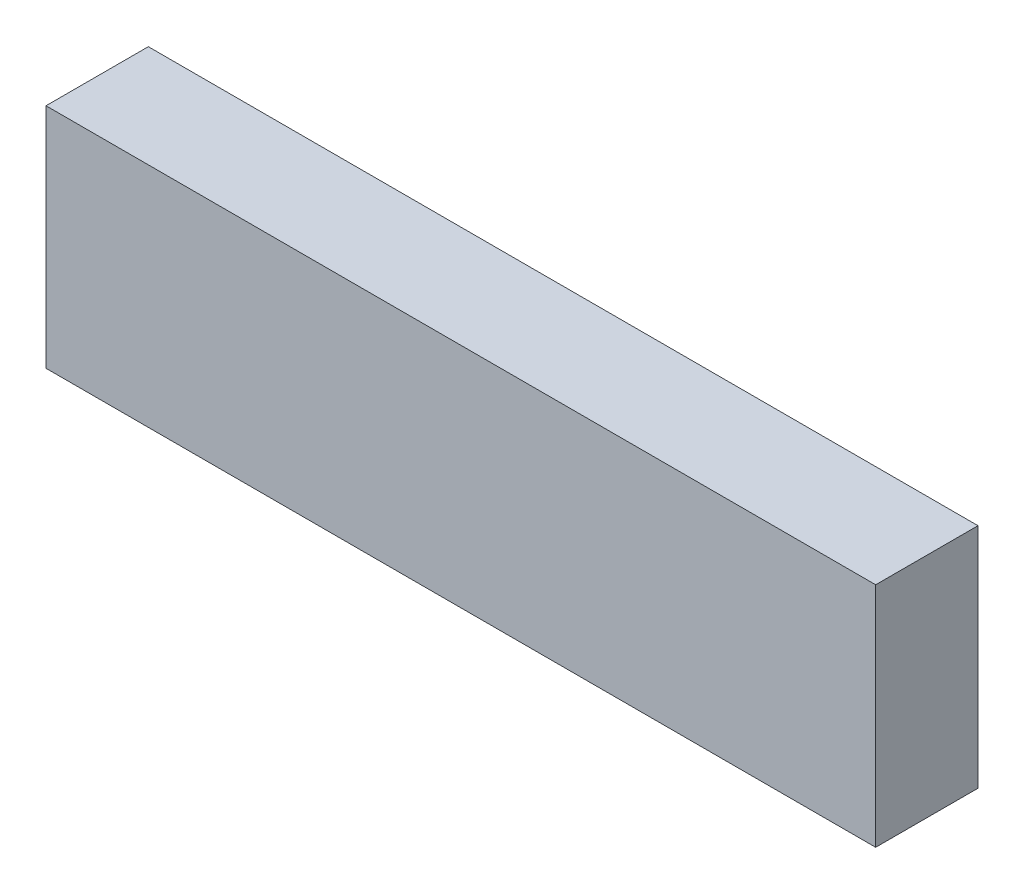
ISO-10303-21;
HEADER;
FILE_DESCRIPTION(('STEP AP214'),'2;1');
FILE_NAME('part.step','',(''),(''),'','','');
FILE_SCHEMA(('AUTOMOTIVE_DESIGN { 1 0 10303 214 1 1 1 1 }'));
ENDSEC;
DATA;
#1=APPLICATION_CONTEXT('core data for automotive mechanical design processes');
#2=APPLICATION_PROTOCOL_DEFINITION('international standard','automotive_design',2000,#1);
#3=PRODUCT_CONTEXT('',#1,'mechanical');
#4=PRODUCT('Part','Part','',(#3));
#5=PRODUCT_RELATED_PRODUCT_CATEGORY('part','',(#4));
#6=PRODUCT_DEFINITION_FORMATION('','',#4);
#7=PRODUCT_DEFINITION_CONTEXT('part definition',#1,'design');
#8=PRODUCT_DEFINITION('design','',#6,#7);
#9=PRODUCT_DEFINITION_SHAPE('','',#8);
#10=(LENGTH_UNIT() NAMED_UNIT(*) SI_UNIT(.MILLI.,.METRE.));
#11=(NAMED_UNIT(*) PLANE_ANGLE_UNIT() SI_UNIT($,.RADIAN.));
#12=(NAMED_UNIT(*) SI_UNIT($,.STERADIAN.) SOLID_ANGLE_UNIT());
#13=UNCERTAINTY_MEASURE_WITH_UNIT(LENGTH_MEASURE(1.E-05),#10,'distance_accuracy_value','');
#14=(GEOMETRIC_REPRESENTATION_CONTEXT(3) GLOBAL_UNCERTAINTY_ASSIGNED_CONTEXT((#13)) GLOBAL_UNIT_ASSIGNED_CONTEXT((#10,
#11,#12)) REPRESENTATION_CONTEXT('',''));
#15=CARTESIAN_POINT('',(0.,0.,0.));
#16=DIRECTION('',(0.,0.,1.));
#17=DIRECTION('',(1.,0.,0.));
#18=AXIS2_PLACEMENT_3D('',#15,#16,#17);
#19=CARTESIAN_POINT('',(0.,0.,0.185));
#20=DIRECTION('',(1.,0.,0.));
#21=DIRECTION('',(0.,0.,-1.));
#22=AXIS2_PLACEMENT_3D('',#19,#20,#21);
#23=PLANE('',#22);
#24=DIRECTION('',(0.,-1.,0.));
#25=VECTOR('',#24,1.);
#26=CARTESIAN_POINT('',(0.,0.,0.));
#27=LINE('',#26,#25);
#28=CARTESIAN_POINT('',(0.,0.411111111111111,0.));
#29=VERTEX_POINT('',#28);
#30=CARTESIAN_POINT('',(0.,0.,0.));
#31=VERTEX_POINT('',#30);
#32=EDGE_CURVE('E96',#29,#31,#27,.T.);
#33=ORIENTED_EDGE('',*,*,#32,.T.);
#34=DIRECTION('',(0.,0.,-1.));
#35=VECTOR('',#34,1.);
#36=CARTESIAN_POINT('',(0.,0.,0.185));
#37=LINE('',#36,#35);
#38=CARTESIAN_POINT('',(0.,0.,0.185));
#39=VERTEX_POINT('',#38);
#40=EDGE_CURVE('E11',#39,#31,#37,.T.);
#41=ORIENTED_EDGE('',*,*,#40,.F.);
#42=DIRECTION('',(0.,-1.,0.));
#43=VECTOR('',#42,1.);
#44=CARTESIAN_POINT('',(0.,0.,0.185));
#45=LINE('',#44,#43);
#46=CARTESIAN_POINT('',(0.,0.411111111111111,0.185));
#47=VERTEX_POINT('',#46);
#48=EDGE_CURVE('E84',#47,#39,#45,.T.);
#49=ORIENTED_EDGE('',*,*,#48,.F.);
#50=DIRECTION('',(0.,0.,-1.));
#51=VECTOR('',#50,1.);
#52=CARTESIAN_POINT('',(0.,0.411111111111111,0.185));
#53=LINE('',#52,#51);
#54=EDGE_CURVE('E92',#47,#29,#53,.T.);
#55=ORIENTED_EDGE('',*,*,#54,.T.);
#56=EDGE_LOOP('',(#33,#41,#49,#55));
#57=FACE_BOUND('',#56,.T.);
#58=ADVANCED_FACE('F33',(#57),#23,.F.);
#59=CARTESIAN_POINT('',(0.,0.,0.185));
#60=DIRECTION('',(0.,1.,0.));
#61=DIRECTION('',(0.,0.,1.));
#62=AXIS2_PLACEMENT_3D('',#59,#60,#61);
#63=PLANE('',#62);
#64=DIRECTION('',(1.,0.,0.));
#65=VECTOR('',#64,1.);
#66=CARTESIAN_POINT('',(0.,0.,0.));
#67=LINE('',#66,#65);
#68=CARTESIAN_POINT('',(1.5,0.,0.));
#69=VERTEX_POINT('',#68);
#70=EDGE_CURVE('E88',#31,#69,#67,.T.);
#71=ORIENTED_EDGE('',*,*,#70,.T.);
#72=DIRECTION('',(0.,0.,-1.));
#73=VECTOR('',#72,1.);
#74=CARTESIAN_POINT('',(1.5,0.,0.185));
#75=LINE('',#74,#73);
#76=CARTESIAN_POINT('',(1.5,0.,0.185));
#77=VERTEX_POINT('',#76);
#78=EDGE_CURVE('E41',#77,#69,#75,.T.);
#79=ORIENTED_EDGE('',*,*,#78,.F.);
#80=DIRECTION('',(1.,0.,0.));
#81=VECTOR('',#80,1.);
#82=CARTESIAN_POINT('',(0.,0.,0.185));
#83=LINE('',#82,#81);
#84=EDGE_CURVE('E79',#39,#77,#83,.T.);
#85=ORIENTED_EDGE('',*,*,#84,.F.);
#86=ORIENTED_EDGE('',*,*,#40,.T.);
#87=EDGE_LOOP('',(#71,#79,#85,#86));
#88=FACE_BOUND('',#87,.T.);
#89=ADVANCED_FACE('F87',(#88),#63,.F.);
#90=CARTESIAN_POINT('',(1.5,0.,0.185));
#91=DIRECTION('',(-1.,0.,0.));
#92=DIRECTION('',(0.,0.,1.));
#93=AXIS2_PLACEMENT_3D('',#90,#91,#92);
#94=PLANE('',#93);
#95=DIRECTION('',(0.,1.,0.));
#96=VECTOR('',#95,1.);
#97=CARTESIAN_POINT('',(1.5,0.,0.));
#98=LINE('',#97,#96);
#99=CARTESIAN_POINT('',(1.5,0.411111111111111,0.));
#100=VERTEX_POINT('',#99);
#101=EDGE_CURVE('E66',#69,#100,#98,.T.);
#102=ORIENTED_EDGE('',*,*,#101,.T.);
#103=DIRECTION('',(0.,0.,-1.));
#104=VECTOR('',#103,1.);
#105=CARTESIAN_POINT('',(1.5,0.411111111111111,0.185));
#106=LINE('',#105,#104);
#107=CARTESIAN_POINT('',(1.5,0.411111111111111,0.185));
#108=VERTEX_POINT('',#107);
#109=EDGE_CURVE('E89',#108,#100,#106,.T.);
#110=ORIENTED_EDGE('',*,*,#109,.F.);
#111=DIRECTION('',(0.,1.,0.));
#112=VECTOR('',#111,1.);
#113=CARTESIAN_POINT('',(1.5,0.,0.185));
#114=LINE('',#113,#112);
#115=EDGE_CURVE('E82',#77,#108,#114,.T.);
#116=ORIENTED_EDGE('',*,*,#115,.F.);
#117=ORIENTED_EDGE('',*,*,#78,.T.);
#118=EDGE_LOOP('',(#102,#110,#116,#117));
#119=FACE_BOUND('',#118,.T.);
#120=ADVANCED_FACE('F90',(#119),#94,.F.);
#121=CARTESIAN_POINT('',(0.,0.411111111111111,0.185));
#122=DIRECTION('',(0.,-1.,0.));
#123=DIRECTION('',(0.,0.,-1.));
#124=AXIS2_PLACEMENT_3D('',#121,#122,#123);
#125=PLANE('',#124);
#126=DIRECTION('',(-1.,0.,0.));
#127=VECTOR('',#126,1.);
#128=CARTESIAN_POINT('',(0.,0.411111111111111,0.));
#129=LINE('',#128,#127);
#130=EDGE_CURVE('E72',#100,#29,#129,.T.);
#131=ORIENTED_EDGE('',*,*,#130,.T.);
#132=ORIENTED_EDGE('',*,*,#54,.F.);
#133=DIRECTION('',(-1.,0.,0.));
#134=VECTOR('',#133,1.);
#135=CARTESIAN_POINT('',(0.,0.411111111111111,0.185));
#136=LINE('',#135,#134);
#137=EDGE_CURVE('E49',#108,#47,#136,.T.);
#138=ORIENTED_EDGE('',*,*,#137,.F.);
#139=ORIENTED_EDGE('',*,*,#109,.T.);
#140=EDGE_LOOP('',(#131,#132,#138,#139));
#141=FACE_BOUND('',#140,.T.);
#142=ADVANCED_FACE('F103',(#141),#125,.F.);
#143=CARTESIAN_POINT('',(0.,0.,0.185));
#144=DIRECTION('',(0.,0.,-1.));
#145=DIRECTION('',(-1.,0.,0.));
#146=AXIS2_PLACEMENT_3D('',#143,#144,#145);
#147=PLANE('',#146);
#148=ORIENTED_EDGE('',*,*,#48,.T.);
#149=ORIENTED_EDGE('',*,*,#84,.T.);
#150=ORIENTED_EDGE('',*,*,#115,.T.);
#151=ORIENTED_EDGE('',*,*,#137,.T.);
#152=EDGE_LOOP('',(#148,#149,#150,#151));
#153=FACE_BOUND('',#152,.T.);
#154=ADVANCED_FACE('F80',(#153),#147,.F.);
#155=CARTESIAN_POINT('',(0.,0.,0.));
#156=DIRECTION('',(0.,0.,-1.));
#157=DIRECTION('',(-1.,0.,0.));
#158=AXIS2_PLACEMENT_3D('',#155,#156,#157);
#159=PLANE('',#158);
#160=ORIENTED_EDGE('',*,*,#32,.F.);
#161=ORIENTED_EDGE('',*,*,#130,.F.);
#162=ORIENTED_EDGE('',*,*,#101,.F.);
#163=ORIENTED_EDGE('',*,*,#70,.F.);
#164=EDGE_LOOP('',(#160,#161,#162,#163));
#165=FACE_BOUND('',#164,.T.);
#166=ADVANCED_FACE('F106',(#165),#159,.T.);
#167=CLOSED_SHELL('',(#58,#89,#120,#142,#154,#166));
#168=MANIFOLD_SOLID_BREP('B2',#167);
#169=ADVANCED_BREP_SHAPE_REPRESENTATION('',(#18,#168),#14);
#170=SHAPE_DEFINITION_REPRESENTATION(#9,#169);
ENDSEC;
END-ISO-10303-21;
